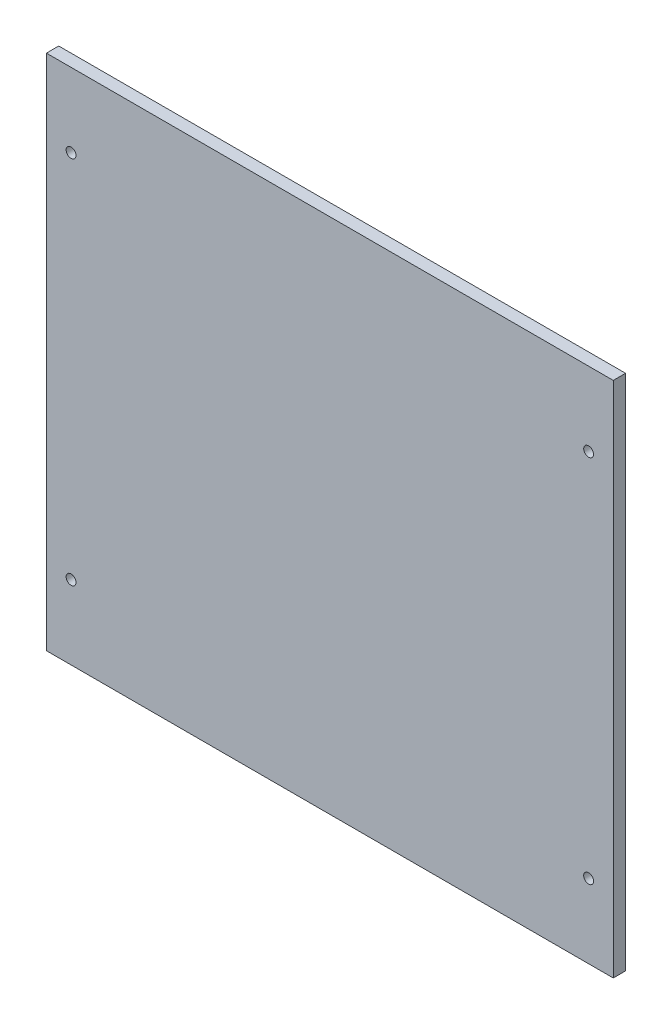
ISO-10303-21;
HEADER;
FILE_DESCRIPTION(('STEP AP214'),'2;1');
FILE_NAME('part.step','',(''),(''),'','','');
FILE_SCHEMA(('AUTOMOTIVE_DESIGN { 1 0 10303 214 1 1 1 1 }'));
ENDSEC;
DATA;
#1=APPLICATION_CONTEXT('core data for automotive mechanical design processes');
#2=APPLICATION_PROTOCOL_DEFINITION('international standard','automotive_design',2000,#1);
#3=PRODUCT_CONTEXT('',#1,'mechanical');
#4=PRODUCT('Part','Part','',(#3));
#5=PRODUCT_RELATED_PRODUCT_CATEGORY('part','',(#4));
#6=PRODUCT_DEFINITION_FORMATION('','',#4);
#7=PRODUCT_DEFINITION_CONTEXT('part definition',#1,'design');
#8=PRODUCT_DEFINITION('design','',#6,#7);
#9=PRODUCT_DEFINITION_SHAPE('','',#8);
#10=(LENGTH_UNIT() NAMED_UNIT(*) SI_UNIT(.MILLI.,.METRE.));
#11=(NAMED_UNIT(*) PLANE_ANGLE_UNIT() SI_UNIT($,.RADIAN.));
#12=(NAMED_UNIT(*) SI_UNIT($,.STERADIAN.) SOLID_ANGLE_UNIT());
#13=UNCERTAINTY_MEASURE_WITH_UNIT(LENGTH_MEASURE(1.E-05),#10,'distance_accuracy_value','');
#14=(GEOMETRIC_REPRESENTATION_CONTEXT(3) GLOBAL_UNCERTAINTY_ASSIGNED_CONTEXT((#13)) GLOBAL_UNIT_ASSIGNED_CONTEXT((#10,
#11,#12)) REPRESENTATION_CONTEXT('',''));
#15=CARTESIAN_POINT('',(0.,0.,0.));
#16=DIRECTION('',(0.,0.,1.));
#17=DIRECTION('',(1.,0.,0.));
#18=AXIS2_PLACEMENT_3D('',#15,#16,#17);
#19=CARTESIAN_POINT('',(115.,105.,5.));
#20=DIRECTION('',(-1.,0.,0.));
#21=DIRECTION('',(0.,-1.,0.));
#22=AXIS2_PLACEMENT_3D('',#19,#20,#21);
#23=PLANE('',#22);
#24=DIRECTION('',(0.,1.,0.));
#25=VECTOR('',#24,1.);
#26=CARTESIAN_POINT('',(115.,105.,0.));
#27=LINE('',#26,#25);
#28=CARTESIAN_POINT('',(115.,-105.,0.));
#29=VERTEX_POINT('',#28);
#30=CARTESIAN_POINT('',(115.,105.,0.));
#31=VERTEX_POINT('',#30);
#32=EDGE_CURVE('E99',#29,#31,#27,.T.);
#33=ORIENTED_EDGE('',*,*,#32,.T.);
#34=DIRECTION('',(0.,0.,-1.));
#35=VECTOR('',#34,1.);
#36=CARTESIAN_POINT('',(115.,105.,5.));
#37=LINE('',#36,#35);
#38=CARTESIAN_POINT('',(115.,105.,5.));
#39=VERTEX_POINT('',#38);
#40=EDGE_CURVE('E11',#39,#31,#37,.T.);
#41=ORIENTED_EDGE('',*,*,#40,.F.);
#42=DIRECTION('',(0.,1.,0.));
#43=VECTOR('',#42,1.);
#44=CARTESIAN_POINT('',(115.,105.,5.));
#45=LINE('',#44,#43);
#46=CARTESIAN_POINT('',(115.,-105.,5.));
#47=VERTEX_POINT('',#46);
#48=EDGE_CURVE('E86',#47,#39,#45,.T.);
#49=ORIENTED_EDGE('',*,*,#48,.F.);
#50=DIRECTION('',(0.,0.,-1.));
#51=VECTOR('',#50,1.);
#52=CARTESIAN_POINT('',(115.,-105.,5.));
#53=LINE('',#52,#51);
#54=EDGE_CURVE('E95',#47,#29,#53,.T.);
#55=ORIENTED_EDGE('',*,*,#54,.T.);
#56=EDGE_LOOP('',(#33,#41,#49,#55));
#57=FACE_BOUND('',#56,.T.);
#58=ADVANCED_FACE('F33',(#57),#23,.F.);
#59=CARTESIAN_POINT('',(-115.,105.,5.));
#60=DIRECTION('',(0.,-1.,0.));
#61=DIRECTION('',(0.,0.,-1.));
#62=AXIS2_PLACEMENT_3D('',#59,#60,#61);
#63=PLANE('',#62);
#64=DIRECTION('',(-1.,0.,0.));
#65=VECTOR('',#64,1.);
#66=CARTESIAN_POINT('',(-115.,105.,0.));
#67=LINE('',#66,#65);
#68=CARTESIAN_POINT('',(-115.,105.,0.));
#69=VERTEX_POINT('',#68);
#70=EDGE_CURVE('E90',#31,#69,#67,.T.);
#71=ORIENTED_EDGE('',*,*,#70,.T.);
#72=DIRECTION('',(0.,0.,-1.));
#73=VECTOR('',#72,1.);
#74=CARTESIAN_POINT('',(-115.,105.,5.));
#75=LINE('',#74,#73);
#76=CARTESIAN_POINT('',(-115.,105.,5.));
#77=VERTEX_POINT('',#76);
#78=EDGE_CURVE('E42',#77,#69,#75,.T.);
#79=ORIENTED_EDGE('',*,*,#78,.F.);
#80=DIRECTION('',(-1.,0.,0.));
#81=VECTOR('',#80,1.);
#82=CARTESIAN_POINT('',(-115.,105.,5.));
#83=LINE('',#82,#81);
#84=EDGE_CURVE('E81',#39,#77,#83,.T.);
#85=ORIENTED_EDGE('',*,*,#84,.F.);
#86=ORIENTED_EDGE('',*,*,#40,.T.);
#87=EDGE_LOOP('',(#71,#79,#85,#86));
#88=FACE_BOUND('',#87,.T.);
#89=ADVANCED_FACE('F89',(#88),#63,.F.);
#90=CARTESIAN_POINT('',(-115.,105.,5.));
#91=DIRECTION('',(1.,0.,0.));
#92=DIRECTION('',(0.,1.,0.));
#93=AXIS2_PLACEMENT_3D('',#90,#91,#92);
#94=PLANE('',#93);
#95=DIRECTION('',(0.,-1.,0.));
#96=VECTOR('',#95,1.);
#97=CARTESIAN_POINT('',(-115.,105.,0.));
#98=LINE('',#97,#96);
#99=CARTESIAN_POINT('',(-115.,-105.,0.));
#100=VERTEX_POINT('',#99);
#101=EDGE_CURVE('E68',#69,#100,#98,.T.);
#102=ORIENTED_EDGE('',*,*,#101,.T.);
#103=DIRECTION('',(0.,0.,-1.));
#104=VECTOR('',#103,1.);
#105=CARTESIAN_POINT('',(-115.,-105.,5.));
#106=LINE('',#105,#104);
#107=CARTESIAN_POINT('',(-115.,-105.,5.));
#108=VERTEX_POINT('',#107);
#109=EDGE_CURVE('E91',#108,#100,#106,.T.);
#110=ORIENTED_EDGE('',*,*,#109,.F.);
#111=DIRECTION('',(0.,-1.,0.));
#112=VECTOR('',#111,1.);
#113=CARTESIAN_POINT('',(-115.,105.,5.));
#114=LINE('',#113,#112);
#115=EDGE_CURVE('E84',#77,#108,#114,.T.);
#116=ORIENTED_EDGE('',*,*,#115,.F.);
#117=ORIENTED_EDGE('',*,*,#78,.T.);
#118=EDGE_LOOP('',(#102,#110,#116,#117));
#119=FACE_BOUND('',#118,.T.);
#120=ADVANCED_FACE('F93',(#119),#94,.F.);
#121=CARTESIAN_POINT('',(-115.,-105.,5.));
#122=DIRECTION('',(0.,1.,0.));
#123=DIRECTION('',(0.,0.,1.));
#124=AXIS2_PLACEMENT_3D('',#121,#122,#123);
#125=PLANE('',#124);
#126=DIRECTION('',(1.,0.,0.));
#127=VECTOR('',#126,1.);
#128=CARTESIAN_POINT('',(-115.,-105.,0.));
#129=LINE('',#128,#127);
#130=EDGE_CURVE('E74',#100,#29,#129,.T.);
#131=ORIENTED_EDGE('',*,*,#130,.T.);
#132=ORIENTED_EDGE('',*,*,#54,.F.);
#133=DIRECTION('',(1.,0.,0.));
#134=VECTOR('',#133,1.);
#135=CARTESIAN_POINT('',(-115.,-105.,5.));
#136=LINE('',#135,#134);
#137=EDGE_CURVE('E51',#108,#47,#136,.T.);
#138=ORIENTED_EDGE('',*,*,#137,.F.);
#139=ORIENTED_EDGE('',*,*,#109,.T.);
#140=EDGE_LOOP('',(#131,#132,#138,#139));
#141=FACE_BOUND('',#140,.T.);
#142=ADVANCED_FACE('F150',(#141),#125,.F.);
#143=CARTESIAN_POINT('',(0.,0.,5.));
#144=DIRECTION('',(0.,0.,1.));
#145=DIRECTION('',(1.,0.,0.));
#146=AXIS2_PLACEMENT_3D('',#143,#144,#145);
#147=PLANE('',#146);
#148=CARTESIAN_POINT('',(105.,75.,5.));
#149=DIRECTION('',(0.,0.,1.));
#150=DIRECTION('',(-1.,0.,0.));
#151=AXIS2_PLACEMENT_3D('',#148,#149,#150);
#152=CIRCLE('',#151,2.);
#153=CARTESIAN_POINT('',(103.,75.,5.));
#154=VERTEX_POINT('',#153);
#155=EDGE_CURVE('E217',#154,#154,#152,.T.);
#156=ORIENTED_EDGE('',*,*,#155,.F.);
#157=EDGE_LOOP('',(#156));
#158=FACE_BOUND('',#157,.T.);
#159=CARTESIAN_POINT('',(105.,-75.,5.));
#160=DIRECTION('',(0.,0.,1.));
#161=DIRECTION('',(-1.,0.,0.));
#162=AXIS2_PLACEMENT_3D('',#159,#160,#161);
#163=CIRCLE('',#162,2.);
#164=CARTESIAN_POINT('',(103.,-75.,5.));
#165=VERTEX_POINT('',#164);
#166=EDGE_CURVE('E212',#165,#165,#163,.T.);
#167=ORIENTED_EDGE('',*,*,#166,.F.);
#168=EDGE_LOOP('',(#167));
#169=FACE_BOUND('',#168,.T.);
#170=CARTESIAN_POINT('',(-105.,-75.,5.));
#171=DIRECTION('',(0.,0.,1.));
#172=DIRECTION('',(1.,0.,0.));
#173=AXIS2_PLACEMENT_3D('',#170,#171,#172);
#174=CIRCLE('',#173,2.);
#175=CARTESIAN_POINT('',(-103.,-75.,5.));
#176=VERTEX_POINT('',#175);
#177=EDGE_CURVE('E205',#176,#176,#174,.T.);
#178=ORIENTED_EDGE('',*,*,#177,.F.);
#179=EDGE_LOOP('',(#178));
#180=FACE_BOUND('',#179,.T.);
#181=CARTESIAN_POINT('',(-105.,75.,5.));
#182=DIRECTION('',(0.,0.,1.));
#183=DIRECTION('',(1.,0.,0.));
#184=AXIS2_PLACEMENT_3D('',#181,#182,#183);
#185=CIRCLE('',#184,2.);
#186=CARTESIAN_POINT('',(-103.,75.,5.));
#187=VERTEX_POINT('',#186);
#188=EDGE_CURVE('E111',#187,#187,#185,.T.);
#189=ORIENTED_EDGE('',*,*,#188,.F.);
#190=EDGE_LOOP('',(#189));
#191=FACE_BOUND('',#190,.T.);
#192=ORIENTED_EDGE('',*,*,#48,.T.);
#193=ORIENTED_EDGE('',*,*,#84,.T.);
#194=ORIENTED_EDGE('',*,*,#115,.T.);
#195=ORIENTED_EDGE('',*,*,#137,.T.);
#196=EDGE_LOOP('',(#192,#193,#194,#195));
#197=FACE_BOUND('',#196,.T.);
#198=ADVANCED_FACE('F82',(#158,#169,#180,#191,#197),#147,.T.);
#199=CARTESIAN_POINT('',(0.,0.,0.));
#200=DIRECTION('',(0.,0.,1.));
#201=DIRECTION('',(1.,0.,0.));
#202=AXIS2_PLACEMENT_3D('',#199,#200,#201);
#203=PLANE('',#202);
#204=CARTESIAN_POINT('',(105.,75.,0.));
#205=DIRECTION('',(0.,0.,1.));
#206=DIRECTION('',(1.,0.,0.));
#207=AXIS2_PLACEMENT_3D('',#204,#205,#206);
#208=CIRCLE('',#207,2.);
#209=CARTESIAN_POINT('',(107.,75.,0.));
#210=VERTEX_POINT('',#209);
#211=EDGE_CURVE('E36',#210,#210,#208,.T.);
#212=ORIENTED_EDGE('',*,*,#211,.T.);
#213=EDGE_LOOP('',(#212));
#214=FACE_BOUND('',#213,.T.);
#215=CARTESIAN_POINT('',(105.,-75.,0.));
#216=DIRECTION('',(0.,0.,1.));
#217=DIRECTION('',(1.,0.,0.));
#218=AXIS2_PLACEMENT_3D('',#215,#216,#217);
#219=CIRCLE('',#218,2.);
#220=CARTESIAN_POINT('',(107.,-75.,0.));
#221=VERTEX_POINT('',#220);
#222=EDGE_CURVE('E113',#221,#221,#219,.T.);
#223=ORIENTED_EDGE('',*,*,#222,.T.);
#224=EDGE_LOOP('',(#223));
#225=FACE_BOUND('',#224,.T.);
#226=CARTESIAN_POINT('',(-105.,-75.,0.));
#227=DIRECTION('',(0.,0.,1.));
#228=DIRECTION('',(1.,0.,0.));
#229=AXIS2_PLACEMENT_3D('',#226,#227,#228);
#230=CIRCLE('',#229,2.);
#231=CARTESIAN_POINT('',(-103.,-75.,0.));
#232=VERTEX_POINT('',#231);
#233=EDGE_CURVE('E110',#232,#232,#230,.T.);
#234=ORIENTED_EDGE('',*,*,#233,.T.);
#235=EDGE_LOOP('',(#234));
#236=FACE_BOUND('',#235,.T.);
#237=CARTESIAN_POINT('',(-105.,75.,0.));
#238=DIRECTION('',(0.,0.,1.));
#239=DIRECTION('',(1.,0.,0.));
#240=AXIS2_PLACEMENT_3D('',#237,#238,#239);
#241=CIRCLE('',#240,2.);
#242=CARTESIAN_POINT('',(-103.,75.,0.));
#243=VERTEX_POINT('',#242);
#244=EDGE_CURVE('E107',#243,#243,#241,.T.);
#245=ORIENTED_EDGE('',*,*,#244,.T.);
#246=EDGE_LOOP('',(#245));
#247=FACE_BOUND('',#246,.T.);
#248=ORIENTED_EDGE('',*,*,#32,.F.);
#249=ORIENTED_EDGE('',*,*,#130,.F.);
#250=ORIENTED_EDGE('',*,*,#101,.F.);
#251=ORIENTED_EDGE('',*,*,#70,.F.);
#252=EDGE_LOOP('',(#248,#249,#250,#251));
#253=FACE_BOUND('',#252,.T.);
#254=ADVANCED_FACE('F120',(#214,#225,#236,#247,#253),#203,.F.);
#255=CARTESIAN_POINT('',(-105.,75.,-20.));
#256=DIRECTION('',(0.,0.,1.));
#257=DIRECTION('',(1.,0.,0.));
#258=AXIS2_PLACEMENT_3D('',#255,#256,#257);
#259=CYLINDRICAL_SURFACE('',#258,2.);
#260=ORIENTED_EDGE('',*,*,#188,.T.);
#261=EDGE_LOOP('',(#260));
#262=FACE_BOUND('',#261,.T.);
#263=ORIENTED_EDGE('',*,*,#244,.F.);
#264=EDGE_LOOP('',(#263));
#265=FACE_BOUND('',#264,.T.);
#266=ADVANCED_FACE('F143',(#262,#265),#259,.F.);
#267=CARTESIAN_POINT('',(-105.,-75.,-20.));
#268=DIRECTION('',(0.,0.,1.));
#269=DIRECTION('',(1.,0.,0.));
#270=AXIS2_PLACEMENT_3D('',#267,#268,#269);
#271=CYLINDRICAL_SURFACE('',#270,2.);
#272=ORIENTED_EDGE('',*,*,#177,.T.);
#273=EDGE_LOOP('',(#272));
#274=FACE_BOUND('',#273,.T.);
#275=ORIENTED_EDGE('',*,*,#233,.F.);
#276=EDGE_LOOP('',(#275));
#277=FACE_BOUND('',#276,.T.);
#278=ADVANCED_FACE('F130',(#274,#277),#271,.F.);
#279=CARTESIAN_POINT('',(105.,-75.,-20.));
#280=DIRECTION('',(0.,0.,1.));
#281=DIRECTION('',(1.,0.,0.));
#282=AXIS2_PLACEMENT_3D('',#279,#280,#281);
#283=CYLINDRICAL_SURFACE('',#282,2.);
#284=ORIENTED_EDGE('',*,*,#166,.T.);
#285=EDGE_LOOP('',(#284));
#286=FACE_BOUND('',#285,.T.);
#287=ORIENTED_EDGE('',*,*,#222,.F.);
#288=EDGE_LOOP('',(#287));
#289=FACE_BOUND('',#288,.T.);
#290=ADVANCED_FACE('F124',(#286,#289),#283,.F.);
#291=CARTESIAN_POINT('',(105.,75.,-20.));
#292=DIRECTION('',(0.,0.,1.));
#293=DIRECTION('',(1.,0.,0.));
#294=AXIS2_PLACEMENT_3D('',#291,#292,#293);
#295=CYLINDRICAL_SURFACE('',#294,2.);
#296=ORIENTED_EDGE('',*,*,#155,.T.);
#297=EDGE_LOOP('',(#296));
#298=FACE_BOUND('',#297,.T.);
#299=ORIENTED_EDGE('',*,*,#211,.F.);
#300=EDGE_LOOP('',(#299));
#301=FACE_BOUND('',#300,.T.);
#302=ADVANCED_FACE('F122',(#298,#301),#295,.F.);
#303=CLOSED_SHELL('',(#58,#89,#120,#142,#198,#254,#266,#278,#290,#302));
#304=MANIFOLD_SOLID_BREP('B2',#303);
#305=ADVANCED_BREP_SHAPE_REPRESENTATION('',(#18,#304),#14);
#306=SHAPE_DEFINITION_REPRESENTATION(#9,#305);
ENDSEC;
END-ISO-10303-21;
